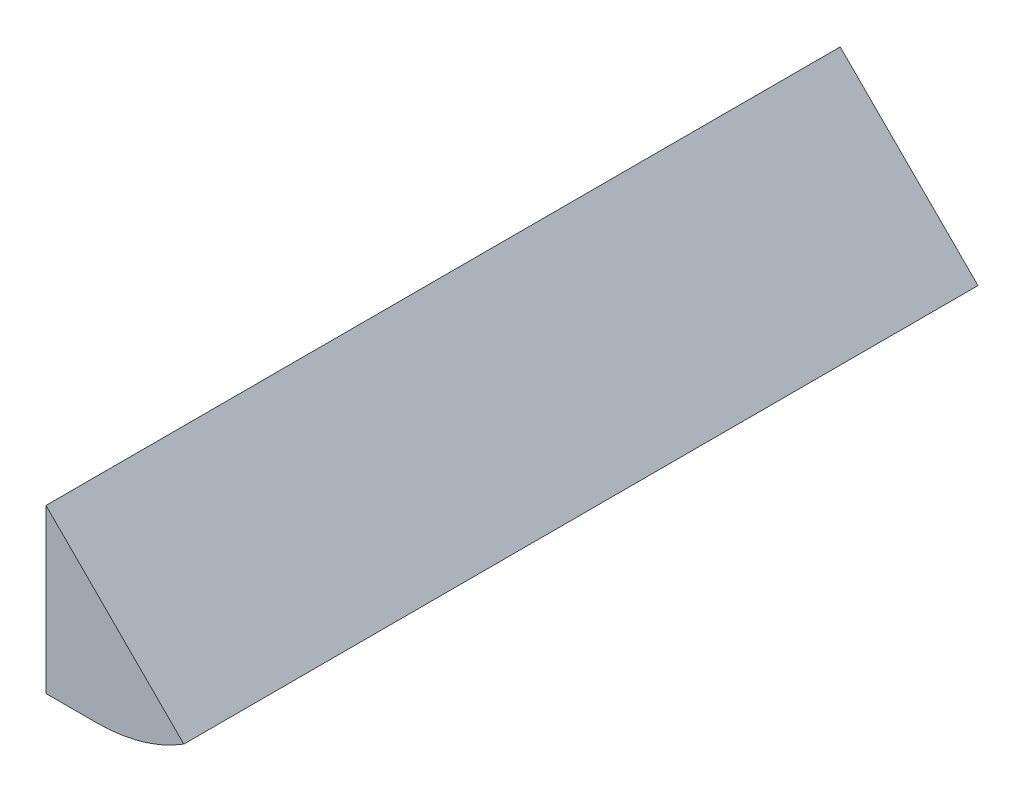
ISO-10303-21;
HEADER;
FILE_DESCRIPTION(('STEP AP214'),'2;1');
FILE_NAME('part.step','',(''),(''),'','','');
FILE_SCHEMA(('AUTOMOTIVE_DESIGN { 1 0 10303 214 1 1 1 1 }'));
ENDSEC;
DATA;
#1=APPLICATION_CONTEXT('core data for automotive mechanical design processes');
#2=APPLICATION_PROTOCOL_DEFINITION('international standard','automotive_design',2000,#1);
#3=PRODUCT_CONTEXT('',#1,'mechanical');
#4=PRODUCT('Part','Part','',(#3));
#5=PRODUCT_RELATED_PRODUCT_CATEGORY('part','',(#4));
#6=PRODUCT_DEFINITION_FORMATION('','',#4);
#7=PRODUCT_DEFINITION_CONTEXT('part definition',#1,'design');
#8=PRODUCT_DEFINITION('design','',#6,#7);
#9=PRODUCT_DEFINITION_SHAPE('','',#8);
#10=(LENGTH_UNIT() NAMED_UNIT(*) SI_UNIT(.MILLI.,.METRE.));
#11=(NAMED_UNIT(*) PLANE_ANGLE_UNIT() SI_UNIT($,.RADIAN.));
#12=(NAMED_UNIT(*) SI_UNIT($,.STERADIAN.) SOLID_ANGLE_UNIT());
#13=UNCERTAINTY_MEASURE_WITH_UNIT(LENGTH_MEASURE(1.E-05),#10,'distance_accuracy_value','');
#14=(GEOMETRIC_REPRESENTATION_CONTEXT(3) GLOBAL_UNCERTAINTY_ASSIGNED_CONTEXT((#13)) GLOBAL_UNIT_ASSIGNED_CONTEXT((#10,
#11,#12)) REPRESENTATION_CONTEXT('',''));
#15=CARTESIAN_POINT('',(0.,0.,0.));
#16=DIRECTION('',(0.,0.,1.));
#17=DIRECTION('',(1.,0.,0.));
#18=AXIS2_PLACEMENT_3D('',#15,#16,#17);
#19=CARTESIAN_POINT('',(-410.,15.9999999999999,-49.9999999999999));
#20=DIRECTION('',(0.707106770426429,0.707106791946666,0.));
#21=DIRECTION('',(-0.707106791946666,0.707106770426429,0.));
#22=AXIS2_PLACEMENT_3D('',#19,#20,#21);
#23=PLANE('',#22);
#24=DIRECTION('',(-0.707106791946666,0.707106770426429,0.));
#25=VECTOR('',#24,1.);
#26=CARTESIAN_POINT('',(-410.,15.9999999999999,-10.9999999999999));
#27=LINE('',#26,#25);
#28=CARTESIAN_POINT('',(-403.232980949843,9.23298115905522,-10.9999999999999));
#29=VERTEX_POINT('',#28);
#30=CARTESIAN_POINT('',(-410.,15.9999999999999,-10.9999999999999));
#31=VERTEX_POINT('',#30);
#32=EDGE_CURVE('E96',#29,#31,#27,.T.);
#33=ORIENTED_EDGE('',*,*,#32,.F.);
#34=DIRECTION('',(0.,0.,1.));
#35=VECTOR('',#34,1.);
#36=CARTESIAN_POINT('',(-403.232980949843,9.23298115905522,-49.9999999999999));
#37=LINE('',#36,#35);
#38=CARTESIAN_POINT('',(-403.232980949843,9.23298115905522,-49.9999999999999));
#39=VERTEX_POINT('',#38);
#40=EDGE_CURVE('E11',#39,#29,#37,.T.);
#41=ORIENTED_EDGE('',*,*,#40,.F.);
#42=DIRECTION('',(-0.707106791946666,0.707106770426429,0.));
#43=VECTOR('',#42,1.);
#44=CARTESIAN_POINT('',(-410.,15.9999999999999,-49.9999999999999));
#45=LINE('',#44,#43);
#46=CARTESIAN_POINT('',(-410.,15.9999999999999,-49.9999999999999));
#47=VERTEX_POINT('',#46);
#48=EDGE_CURVE('E90',#39,#47,#45,.T.);
#49=ORIENTED_EDGE('',*,*,#48,.T.);
#50=DIRECTION('',(0.,0.,1.));
#51=VECTOR('',#50,1.);
#52=CARTESIAN_POINT('',(-410.,15.9999999999999,-49.9999999999999));
#53=LINE('',#52,#51);
#54=EDGE_CURVE('E35',#47,#31,#53,.T.);
#55=ORIENTED_EDGE('',*,*,#54,.T.);
#56=EDGE_LOOP('',(#33,#41,#49,#55));
#57=FACE_BOUND('',#56,.T.);
#58=ADVANCED_FACE('F32',(#57),#23,.T.);
#59=CARTESIAN_POINT('',(-407.5,15.9999997147528,-49.9999999999999));
#60=DIRECTION('',(0.,0.,1.));
#61=DIRECTION('',(1.,0.,0.));
#62=AXIS2_PLACEMENT_3D('',#59,#60,#61);
#63=CYLINDRICAL_SURFACE('',#62,7.99999948172251);
#64=CARTESIAN_POINT('',(-407.5,15.9999997147528,-10.9999999999999));
#65=DIRECTION('',(0.,0.,1.));
#66=DIRECTION('',(1.,0.,0.));
#67=AXIS2_PLACEMENT_3D('',#64,#65,#66);
#68=CIRCLE('',#67,7.99999948172251);
#69=CARTESIAN_POINT('',(-407.5,8.00000024347367,-10.9999999999999));
#70=VERTEX_POINT('',#69);
#71=EDGE_CURVE('E92',#70,#29,#68,.T.);
#72=ORIENTED_EDGE('',*,*,#71,.F.);
#73=DIRECTION('',(0.,0.,1.));
#74=VECTOR('',#73,1.);
#75=CARTESIAN_POINT('',(-407.5,8.00000024347367,-49.9999999999999));
#76=LINE('',#75,#74);
#77=CARTESIAN_POINT('',(-407.5,8.00000024347367,-49.9999999999999));
#78=VERTEX_POINT('',#77);
#79=EDGE_CURVE('E41',#78,#70,#76,.T.);
#80=ORIENTED_EDGE('',*,*,#79,.F.);
#81=CARTESIAN_POINT('',(-407.5,15.9999997147528,-49.9999999999999));
#82=DIRECTION('',(0.,0.,1.));
#83=DIRECTION('',(1.,0.,0.));
#84=AXIS2_PLACEMENT_3D('',#81,#82,#83);
#85=CIRCLE('',#84,7.99999948172251);
#86=EDGE_CURVE('E87',#78,#39,#85,.T.);
#87=ORIENTED_EDGE('',*,*,#86,.T.);
#88=ORIENTED_EDGE('',*,*,#40,.T.);
#89=EDGE_LOOP('',(#72,#80,#87,#88));
#90=FACE_BOUND('',#89,.T.);
#91=ADVANCED_FACE('F106',(#90),#63,.T.);
#92=CARTESIAN_POINT('',(-407.5,8.00000024347367,-49.9999999999999));
#93=DIRECTION('',(9.73895124267769E-08,-0.999999999999995,0.));
#94=DIRECTION('',(0.999999999999995,9.73895124267769E-08,0.));
#95=AXIS2_PLACEMENT_3D('',#92,#93,#94);
#96=PLANE('',#95);
#97=DIRECTION('',(0.999999999999995,9.73895124267769E-08,0.));
#98=VECTOR('',#97,1.);
#99=CARTESIAN_POINT('',(-407.5,8.00000024347367,-10.9999999999999));
#100=LINE('',#99,#98);
#101=CARTESIAN_POINT('',(-410.,7.99999999999989,-10.9999999999999));
#102=VERTEX_POINT('',#101);
#103=EDGE_CURVE('E82',#102,#70,#100,.T.);
#104=ORIENTED_EDGE('',*,*,#103,.F.);
#105=DIRECTION('',(0.,0.,1.));
#106=VECTOR('',#105,1.);
#107=CARTESIAN_POINT('',(-410.,7.99999999999989,-49.9999999999999));
#108=LINE('',#107,#106);
#109=CARTESIAN_POINT('',(-410.,7.99999999999989,-49.9999999999999));
#110=VERTEX_POINT('',#109);
#111=EDGE_CURVE('E77',#110,#102,#108,.T.);
#112=ORIENTED_EDGE('',*,*,#111,.F.);
#113=DIRECTION('',(0.999999999999995,9.73895124267769E-08,0.));
#114=VECTOR('',#113,1.);
#115=CARTESIAN_POINT('',(-407.5,8.00000024347367,-49.9999999999999));
#116=LINE('',#115,#114);
#117=EDGE_CURVE('E80',#110,#78,#116,.T.);
#118=ORIENTED_EDGE('',*,*,#117,.T.);
#119=ORIENTED_EDGE('',*,*,#79,.T.);
#120=EDGE_LOOP('',(#104,#112,#118,#119));
#121=FACE_BOUND('',#120,.T.);
#122=ADVANCED_FACE('F79',(#121),#96,.T.);
#123=CARTESIAN_POINT('',(-410.,15.9999999999999,-49.9999999999999));
#124=DIRECTION('',(-1.,0.,0.));
#125=DIRECTION('',(0.,0.,1.));
#126=AXIS2_PLACEMENT_3D('',#123,#124,#125);
#127=PLANE('',#126);
#128=DIRECTION('',(0.,-1.,0.));
#129=VECTOR('',#128,1.);
#130=CARTESIAN_POINT('',(-410.,15.9999999999999,-10.9999999999999));
#131=LINE('',#130,#129);
#132=EDGE_CURVE('E99',#31,#102,#131,.T.);
#133=ORIENTED_EDGE('',*,*,#132,.F.);
#134=ORIENTED_EDGE('',*,*,#54,.F.);
#135=DIRECTION('',(0.,-1.,0.));
#136=VECTOR('',#135,1.);
#137=CARTESIAN_POINT('',(-410.,15.9999999999999,-49.9999999999999));
#138=LINE('',#137,#136);
#139=EDGE_CURVE('E86',#47,#110,#138,.T.);
#140=ORIENTED_EDGE('',*,*,#139,.T.);
#141=ORIENTED_EDGE('',*,*,#111,.T.);
#142=EDGE_LOOP('',(#133,#134,#140,#141));
#143=FACE_BOUND('',#142,.T.);
#144=ADVANCED_FACE('F89',(#143),#127,.T.);
#145=CARTESIAN_POINT('',(-407.5,15.9999997147528,-49.9999999999999));
#146=DIRECTION('',(0.,0.,1.));
#147=DIRECTION('',(1.,0.,0.));
#148=AXIS2_PLACEMENT_3D('',#145,#146,#147);
#149=PLANE('',#148);
#150=ORIENTED_EDGE('',*,*,#48,.F.);
#151=ORIENTED_EDGE('',*,*,#86,.F.);
#152=ORIENTED_EDGE('',*,*,#117,.F.);
#153=ORIENTED_EDGE('',*,*,#139,.F.);
#154=EDGE_LOOP('',(#150,#151,#152,#153));
#155=FACE_BOUND('',#154,.T.);
#156=ADVANCED_FACE('F85',(#155),#149,.F.);
#157=CARTESIAN_POINT('',(-407.5,15.9999997147528,-10.9999999999999));
#158=DIRECTION('',(0.,0.,1.));
#159=DIRECTION('',(1.,0.,0.));
#160=AXIS2_PLACEMENT_3D('',#157,#158,#159);
#161=PLANE('',#160);
#162=ORIENTED_EDGE('',*,*,#32,.T.);
#163=ORIENTED_EDGE('',*,*,#132,.T.);
#164=ORIENTED_EDGE('',*,*,#103,.T.);
#165=ORIENTED_EDGE('',*,*,#71,.T.);
#166=EDGE_LOOP('',(#162,#163,#164,#165));
#167=FACE_BOUND('',#166,.T.);
#168=ADVANCED_FACE('F105',(#167),#161,.T.);
#169=CLOSED_SHELL('',(#58,#91,#122,#144,#156,#168));
#170=MANIFOLD_SOLID_BREP('B2',#169);
#171=ADVANCED_BREP_SHAPE_REPRESENTATION('',(#18,#170),#14);
#172=SHAPE_DEFINITION_REPRESENTATION(#9,#171);
ENDSEC;
END-ISO-10303-21;
